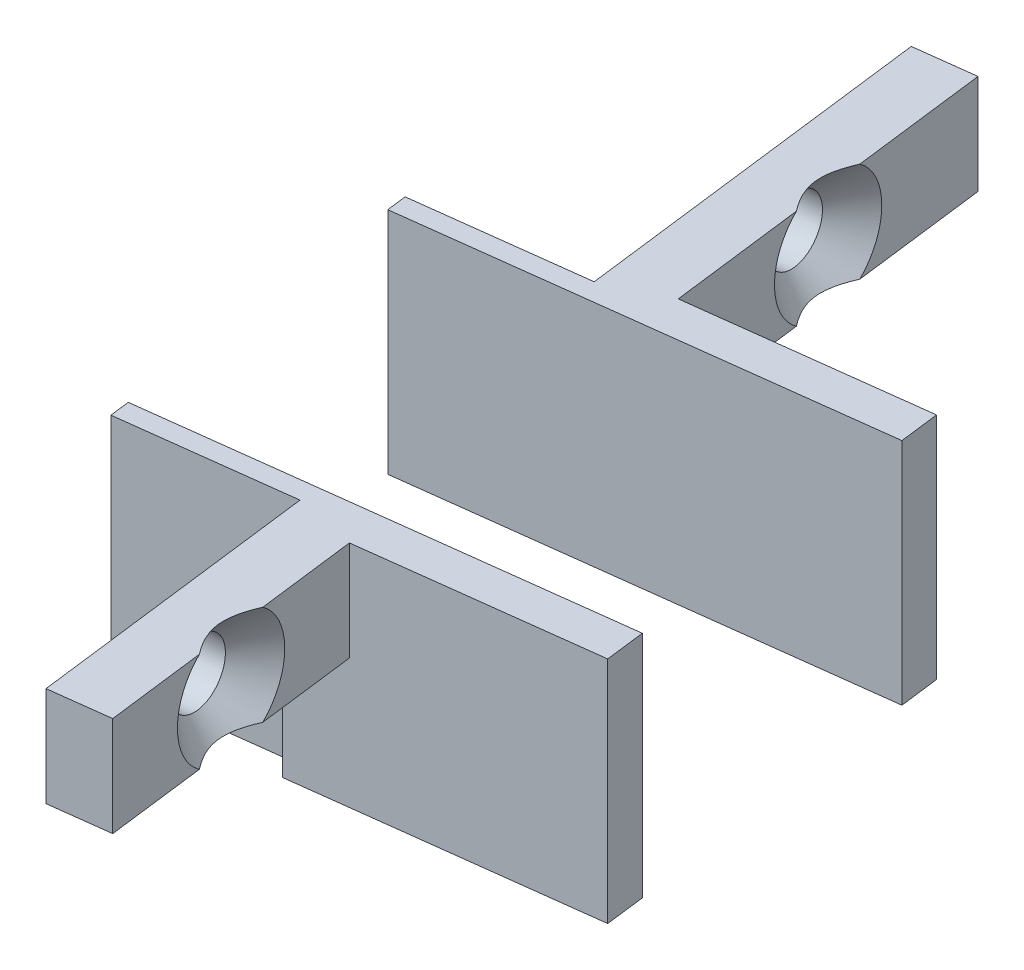
ISO-10303-21;
HEADER;
FILE_DESCRIPTION(('STEP AP214'),'2;1');
FILE_NAME('part.step','',(''),(''),'','','');
FILE_SCHEMA(('AUTOMOTIVE_DESIGN { 1 0 10303 214 1 1 1 1 }'));
ENDSEC;
DATA;
#1=APPLICATION_CONTEXT('core data for automotive mechanical design processes');
#2=APPLICATION_PROTOCOL_DEFINITION('international standard','automotive_design',2000,#1);
#3=PRODUCT_CONTEXT('',#1,'mechanical');
#4=PRODUCT('Part','Part','',(#3));
#5=PRODUCT_RELATED_PRODUCT_CATEGORY('part','',(#4));
#6=PRODUCT_DEFINITION_FORMATION('','',#4);
#7=PRODUCT_DEFINITION_CONTEXT('part definition',#1,'design');
#8=PRODUCT_DEFINITION('design','',#6,#7);
#9=PRODUCT_DEFINITION_SHAPE('','',#8);
#10=(LENGTH_UNIT() NAMED_UNIT(*) SI_UNIT(.MILLI.,.METRE.));
#11=(NAMED_UNIT(*) PLANE_ANGLE_UNIT() SI_UNIT($,.RADIAN.));
#12=(NAMED_UNIT(*) SI_UNIT($,.STERADIAN.) SOLID_ANGLE_UNIT());
#13=UNCERTAINTY_MEASURE_WITH_UNIT(LENGTH_MEASURE(1.E-05),#10,'distance_accuracy_value','');
#14=(GEOMETRIC_REPRESENTATION_CONTEXT(3) GLOBAL_UNCERTAINTY_ASSIGNED_CONTEXT((#13)) GLOBAL_UNIT_ASSIGNED_CONTEXT((#10,
#11,#12)) REPRESENTATION_CONTEXT('',''));
#15=CARTESIAN_POINT('',(0.,0.,0.));
#16=DIRECTION('',(0.,0.,1.));
#17=DIRECTION('',(1.,0.,0.));
#18=AXIS2_PLACEMENT_3D('',#15,#16,#17);
#19=CARTESIAN_POINT('',(114.758192533677,-13.5,-167.394485901356));
#20=DIRECTION('',(-0.123954699359963,0.,-0.992287877839179));
#21=DIRECTION('',(-0.992287877839179,0.,0.123954699359963));
#22=AXIS2_PLACEMENT_3D('',#19,#20,#21);
#23=PLANE('',#22);
#24=DIRECTION('',(-0.992287877839179,0.,0.123954699359963));
#25=VECTOR('',#24,1.);
#26=CARTESIAN_POINT('',(114.758192533677,-13.5,-167.394485901356));
#27=LINE('',#26,#25);
#28=CARTESIAN_POINT('',(129.256443078158,-13.5,-169.205579564417));
#29=VERTEX_POINT('',#28);
#30=CARTESIAN_POINT('',(114.758192533677,-13.5,-167.394485901356));
#31=VERTEX_POINT('',#30);
#32=EDGE_CURVE('E235',#29,#31,#27,.T.);
#33=ORIENTED_EDGE('',*,*,#32,.F.);
#34=DIRECTION('',(0.,1.,0.));
#35=VECTOR('',#34,1.);
#36=CARTESIAN_POINT('',(129.256443078158,-13.5,-169.205579564417));
#37=LINE('',#36,#35);
#38=CARTESIAN_POINT('',(129.256443078158,-2.,-169.205579564417));
#39=VERTEX_POINT('',#38);
#40=EDGE_CURVE('E206',#29,#39,#37,.T.);
#41=ORIENTED_EDGE('',*,*,#40,.T.);
#42=DIRECTION('',(-0.992287877839179,0.,0.123954699359963));
#43=VECTOR('',#42,1.);
#44=CARTESIAN_POINT('',(114.758192533677,-2.,-167.394485901356));
#45=LINE('',#44,#43);
#46=CARTESIAN_POINT('',(117.735056167195,-2.,-167.766349999436));
#47=VERTEX_POINT('',#46);
#48=EDGE_CURVE('E205',#39,#47,#45,.T.);
#49=ORIENTED_EDGE('',*,*,#48,.T.);
#50=DIRECTION('',(0.,1.,0.));
#51=VECTOR('',#50,1.);
#52=CARTESIAN_POINT('',(117.735056167195,-7.,-167.766349999436));
#53=LINE('',#52,#51);
#54=CARTESIAN_POINT('',(117.735056167195,-7.,-167.766349999436));
#55=VERTEX_POINT('',#54);
#56=EDGE_CURVE('E214',#55,#47,#53,.T.);
#57=ORIENTED_EDGE('',*,*,#56,.F.);
#58=DIRECTION('',(0.992287877839179,0.,-0.123954699359962));
#59=VECTOR('',#58,1.);
#60=CARTESIAN_POINT('',(117.735056167195,-7.,-167.766349999436));
#61=LINE('',#60,#59);
#62=CARTESIAN_POINT('',(114.758192533677,-7.,-167.394485901356));
#63=VERTEX_POINT('',#62);
#64=EDGE_CURVE('E193',#63,#55,#61,.T.);
#65=ORIENTED_EDGE('',*,*,#64,.F.);
#66=DIRECTION('',(0.,1.,0.));
#67=VECTOR('',#66,1.);
#68=CARTESIAN_POINT('',(114.758192533677,-13.5,-167.394485901356));
#69=LINE('',#68,#67);
#70=EDGE_CURVE('E204',#31,#63,#69,.T.);
#71=ORIENTED_EDGE('',*,*,#70,.F.);
#72=EDGE_LOOP('',(#33,#41,#49,#57,#65,#71));
#73=FACE_BOUND('',#72,.T.);
#74=ADVANCED_FACE('F70',(#73),#23,.F.);
#75=CARTESIAN_POINT('',(148.082521914135,0.5,-18.4981847448383));
#76=DIRECTION('',(-0.992287877839178,0.,0.123954699359969));
#77=DIRECTION('',(0.123954699359969,0.,0.992287877839178));
#78=AXIS2_PLACEMENT_3D('',#75,#76,#77);
#79=PLANE('',#78);
#80=DIRECTION('',(-0.123954699359969,0.,-0.992287877839178));
#81=VECTOR('',#80,1.);
#82=CARTESIAN_POINT('',(148.082521914135,-2.,-18.4981847448383));
#83=LINE('',#82,#81);
#84=CARTESIAN_POINT('',(129.008533679438,-2.,-171.190155320095));
#85=VERTEX_POINT('',#84);
#86=EDGE_CURVE('E241',#39,#85,#83,.T.);
#87=ORIENTED_EDGE('',*,*,#86,.F.);
#88=ORIENTED_EDGE('',*,*,#40,.F.);
#89=DIRECTION('',(0.123954699359969,0.,0.992287877839178));
#90=VECTOR('',#89,1.);
#91=CARTESIAN_POINT('',(148.082521914135,-13.5,-18.4981847448383));
#92=LINE('',#91,#90);
#93=CARTESIAN_POINT('',(129.008533679438,-13.5,-171.190155320095));
#94=VERTEX_POINT('',#93);
#95=EDGE_CURVE('E217',#94,#29,#92,.T.);
#96=ORIENTED_EDGE('',*,*,#95,.F.);
#97=DIRECTION('',(0.,1.,0.));
#98=VECTOR('',#97,1.);
#99=CARTESIAN_POINT('',(129.008533679438,-13.5,-171.190155320095));
#100=LINE('',#99,#98);
#101=EDGE_CURVE('E201',#94,#85,#100,.T.);
#102=ORIENTED_EDGE('',*,*,#101,.T.);
#103=EDGE_LOOP('',(#87,#88,#96,#102));
#104=FACE_BOUND('',#103,.T.);
#105=ADVANCED_FACE('F264',(#104),#79,.F.);
#106=CARTESIAN_POINT('',(118.538810864156,-2.,-137.129705627261));
#107=DIRECTION('',(0.992287877839178,0.,-0.12395469935997));
#108=DIRECTION('',(-0.12395469935997,0.,-0.992287877839178));
#109=AXIS2_PLACEMENT_3D('',#106,#107,#108);
#110=PLANE('',#109);
#111=CARTESIAN_POINT('',(115.60588337206,-4.5,-160.608512094586));
#112=DIRECTION('',(0.992287877839178,0.,-0.12395469935997));
#113=DIRECTION('',(-0.12395469935997,0.,-0.992287877839178));
#114=AXIS2_PLACEMENT_3D('',#111,#112,#113);
#115=CIRCLE('',#114,1.59999999999997);
#116=CARTESIAN_POINT('',(115.407555853084,-4.5,-162.196172699129));
#117=VERTEX_POINT('',#116);
#118=EDGE_CURVE('E192',#117,#117,#115,.F.);
#119=ORIENTED_EDGE('',*,*,#118,.F.);
#120=EDGE_LOOP('',(#119));
#121=FACE_BOUND('',#120,.T.);
#122=DIRECTION('',(0.12395469935997,0.,0.992287877839178));
#123=VECTOR('',#122,1.);
#124=CARTESIAN_POINT('',(118.538810864156,-2.,-137.129705627261));
#125=LINE('',#124,#123);
#126=CARTESIAN_POINT('',(114.634237834317,-2.,-168.386773779195));
#127=VERTEX_POINT('',#126);
#128=CARTESIAN_POINT('',(116.453574210443,-2.,-153.822538287816));
#129=VERTEX_POINT('',#128);
#130=EDGE_CURVE('E232',#127,#129,#125,.T.);
#131=ORIENTED_EDGE('',*,*,#130,.F.);
#132=DIRECTION('',(0.,1.,0.));
#133=VECTOR('',#132,1.);
#134=CARTESIAN_POINT('',(114.634237834317,-2.,-168.386773779195));
#135=LINE('',#134,#133);
#136=CARTESIAN_POINT('',(114.634237834317,-13.5,-168.386773779195));
#137=VERTEX_POINT('',#136);
#138=EDGE_CURVE('E194',#137,#127,#135,.T.);
#139=ORIENTED_EDGE('',*,*,#138,.F.);
#140=DIRECTION('',(-0.12395469935997,0.,-0.992287877839178));
#141=VECTOR('',#140,1.);
#142=CARTESIAN_POINT('',(118.538810864156,-13.5,-137.129705627261));
#143=LINE('',#142,#141);
#144=EDGE_CURVE('E80',#31,#137,#143,.T.);
#145=ORIENTED_EDGE('',*,*,#144,.F.);
#146=ORIENTED_EDGE('',*,*,#70,.T.);
#147=DIRECTION('',(-0.123954699359968,0.,-0.992287877839178));
#148=VECTOR('',#147,1.);
#149=CARTESIAN_POINT('',(116.453574210443,-7.,-153.822538287816));
#150=LINE('',#149,#148);
#151=CARTESIAN_POINT('',(116.453574210443,-7.,-153.822538287816));
#152=VERTEX_POINT('',#151);
#153=EDGE_CURVE('E227',#152,#63,#150,.T.);
#154=ORIENTED_EDGE('',*,*,#153,.F.);
#155=DIRECTION('',(0.,1.,0.));
#156=VECTOR('',#155,1.);
#157=CARTESIAN_POINT('',(116.453574210443,-7.,-153.822538287816));
#158=LINE('',#157,#156);
#159=EDGE_CURVE('E198',#152,#129,#158,.T.);
#160=ORIENTED_EDGE('',*,*,#159,.T.);
#161=EDGE_LOOP('',(#131,#139,#145,#146,#154,#160));
#162=FACE_BOUND('',#161,.T.);
#163=ADVANCED_FACE('F259',(#121,#162),#110,.F.);
#164=CARTESIAN_POINT('',(106.199790872684,-2.,-167.333158834636));
#165=DIRECTION('',(-0.123954699359963,0.,-0.992287877839179));
#166=DIRECTION('',(-0.992287877839179,0.,0.123954699359963));
#167=AXIS2_PLACEMENT_3D('',#164,#165,#166);
#168=PLANE('',#167);
#169=DIRECTION('',(0.992287877839179,0.,-0.123954699359963));
#170=VECTOR('',#169,1.);
#171=CARTESIAN_POINT('',(106.199790872684,-2.,-167.333158834636));
#172=LINE('',#171,#170);
#173=CARTESIAN_POINT('',(106.199790872684,-2.,-167.333158834636));
#174=VERTEX_POINT('',#173);
#175=EDGE_CURVE('E237',#174,#127,#172,.T.);
#176=ORIENTED_EDGE('',*,*,#175,.F.);
#177=DIRECTION('',(0.,1.,0.));
#178=VECTOR('',#177,1.);
#179=CARTESIAN_POINT('',(106.199790872684,-2.,-167.333158834636));
#180=LINE('',#179,#178);
#181=CARTESIAN_POINT('',(106.199790872684,-13.5,-167.333158834636));
#182=VERTEX_POINT('',#181);
#183=EDGE_CURVE('E197',#182,#174,#180,.T.);
#184=ORIENTED_EDGE('',*,*,#183,.F.);
#185=DIRECTION('',(-0.992287877839179,0.,0.123954699359963));
#186=VECTOR('',#185,1.);
#187=CARTESIAN_POINT('',(106.199790872684,-13.5,-167.333158834636));
#188=LINE('',#187,#186);
#189=EDGE_CURVE('E13',#137,#182,#188,.T.);
#190=ORIENTED_EDGE('',*,*,#189,.F.);
#191=ORIENTED_EDGE('',*,*,#138,.T.);
#192=EDGE_LOOP('',(#176,#184,#190,#191));
#193=FACE_BOUND('',#192,.T.);
#194=ADVANCED_FACE('F263',(#193),#168,.F.);
#195=CARTESIAN_POINT('',(104.092560983565,-2.,-184.202052757902));
#196=DIRECTION('',(0.992287877839178,0.,-0.123954699359969));
#197=DIRECTION('',(-0.123954699359969,0.,-0.992287877839178));
#198=AXIS2_PLACEMENT_3D('',#195,#196,#197);
#199=PLANE('',#198);
#200=DIRECTION('',(0.123954699359969,0.,0.992287877839178));
#201=VECTOR('',#200,1.);
#202=CARTESIAN_POINT('',(104.092560983565,-2.,-184.202052757902));
#203=LINE('',#202,#201);
#204=CARTESIAN_POINT('',(106.075836173324,-2.,-168.325446712475));
#205=VERTEX_POINT('',#204);
#206=EDGE_CURVE('E74',#205,#174,#203,.T.);
#207=ORIENTED_EDGE('',*,*,#206,.F.);
#208=DIRECTION('',(0.,1.,0.));
#209=VECTOR('',#208,1.);
#210=CARTESIAN_POINT('',(106.075836173324,-2.,-168.325446712475));
#211=LINE('',#210,#209);
#212=CARTESIAN_POINT('',(106.075836173324,-13.5,-168.325446712475));
#213=VERTEX_POINT('',#212);
#214=EDGE_CURVE('E179',#213,#205,#211,.T.);
#215=ORIENTED_EDGE('',*,*,#214,.F.);
#216=DIRECTION('',(-0.123954699359969,0.,-0.992287877839178));
#217=VECTOR('',#216,1.);
#218=CARTESIAN_POINT('',(104.092560983565,-13.5,-184.202052757902));
#219=LINE('',#218,#217);
#220=EDGE_CURVE('E218',#182,#213,#219,.T.);
#221=ORIENTED_EDGE('',*,*,#220,.F.);
#222=ORIENTED_EDGE('',*,*,#183,.T.);
#223=EDGE_LOOP('',(#207,#215,#221,#222));
#224=FACE_BOUND('',#223,.T.);
#225=ADVANCED_FACE('F268',(#224),#199,.F.);
#226=CARTESIAN_POINT('',(119.430437843961,-7.,-154.194402385896));
#227=DIRECTION('',(-0.992287877839179,0.,0.123954699359959));
#228=DIRECTION('',(0.123954699359959,0.,0.99228787783918));
#229=AXIS2_PLACEMENT_3D('',#226,#227,#228);
#230=PLANE('',#229);
#231=DIRECTION('',(0.123954699359959,0.,0.992287877839179));
#232=VECTOR('',#231,1.);
#233=CARTESIAN_POINT('',(119.430437843961,-2.,-154.194402385896));
#234=LINE('',#233,#232);
#235=CARTESIAN_POINT('',(118.355534288553,-2.,-162.79926991722));
#236=VERTEX_POINT('',#235);
#237=EDGE_CURVE('E182',#47,#236,#234,.T.);
#238=ORIENTED_EDGE('',*,*,#237,.T.);
#239=CARTESIAN_POINT('',(118.582747005578,-4.5,-160.980376192666));
#240=DIRECTION('',(-0.992287877839179,0.,0.123954699359959));
#241=DIRECTION('',(0.123954699359959,0.,0.99228787783918));
#242=AXIS2_PLACEMENT_3D('',#239,#240,#241);
#243=CIRCLE('',#242,3.09999999999998);
#244=CARTESIAN_POINT('',(118.355534288553,-7.,-162.79926991722));
#245=VERTEX_POINT('',#244);
#246=EDGE_CURVE('E188',#236,#245,#243,.T.);
#247=ORIENTED_EDGE('',*,*,#246,.T.);
#248=DIRECTION('',(0.123954699359959,0.,0.992287877839179));
#249=VECTOR('',#248,1.);
#250=CARTESIAN_POINT('',(119.430437843961,-7.,-154.194402385896));
#251=LINE('',#250,#249);
#252=EDGE_CURVE('E161',#55,#245,#251,.T.);
#253=ORIENTED_EDGE('',*,*,#252,.F.);
#254=ORIENTED_EDGE('',*,*,#56,.T.);
#255=EDGE_LOOP('',(#238,#247,#253,#254));
#256=FACE_BOUND('',#255,.T.);
#257=ADVANCED_FACE('F273',(#256),#230,.F.);
#258=CARTESIAN_POINT('',(114.510283134957,-13.5,-169.379061657034));
#259=DIRECTION('',(0.123954699359963,0.,0.992287877839179));
#260=DIRECTION('',(0.992287877839179,0.,-0.123954699359963));
#261=AXIS2_PLACEMENT_3D('',#258,#259,#260);
#262=PLANE('',#261);
#263=DIRECTION('',(0.992287877839179,0.,-0.123954699359963));
#264=VECTOR('',#263,1.);
#265=CARTESIAN_POINT('',(114.510283134957,-2.,-169.379061657034));
#266=LINE('',#265,#264);
#267=EDGE_CURVE('E184',#205,#85,#266,.T.);
#268=ORIENTED_EDGE('',*,*,#267,.T.);
#269=ORIENTED_EDGE('',*,*,#101,.F.);
#270=DIRECTION('',(0.992287877839179,0.,-0.123954699359962));
#271=VECTOR('',#270,1.);
#272=CARTESIAN_POINT('',(114.510283134957,-13.5,-169.379061657034));
#273=LINE('',#272,#271);
#274=EDGE_CURVE('E215',#213,#94,#273,.T.);
#275=ORIENTED_EDGE('',*,*,#274,.F.);
#276=ORIENTED_EDGE('',*,*,#214,.T.);
#277=EDGE_LOOP('',(#268,#269,#275,#276));
#278=FACE_BOUND('',#277,.T.);
#279=ADVANCED_FACE('F270',(#278),#262,.F.);
#280=CARTESIAN_POINT('',(118.809959722603,-7.,-159.161482468112));
#281=VERTEX_POINT('',#280);
#282=CARTESIAN_POINT('',(119.430437843961,-7.,-154.194402385896));
#283=VERTEX_POINT('',#282);
#284=EDGE_CURVE('E153',#281,#283,#251,.T.);
#285=ORIENTED_EDGE('',*,*,#284,.F.);
#286=CARTESIAN_POINT('',(118.582747005578,-4.5,-160.980376192666));
#287=DIRECTION('',(-0.992287877839179,0.,0.123954699359959));
#288=DIRECTION('',(0.123954699359959,0.,0.99228787783918));
#289=AXIS2_PLACEMENT_3D('',#286,#287,#288);
#290=CIRCLE('',#289,3.09999999999998);
#291=CARTESIAN_POINT('',(118.809959722603,-2.,-159.161482468112));
#292=VERTEX_POINT('',#291);
#293=EDGE_CURVE('E170',#281,#292,#290,.T.);
#294=ORIENTED_EDGE('',*,*,#293,.T.);
#295=CARTESIAN_POINT('',(119.430437843961,-2.,-154.194402385896));
#296=VERTEX_POINT('',#295);
#297=EDGE_CURVE('E134',#292,#296,#234,.T.);
#298=ORIENTED_EDGE('',*,*,#297,.T.);
#299=DIRECTION('',(0.,1.,0.));
#300=VECTOR('',#299,1.);
#301=CARTESIAN_POINT('',(119.430437843961,-7.,-154.194402385896));
#302=LINE('',#301,#300);
#303=EDGE_CURVE('E173',#283,#296,#302,.T.);
#304=ORIENTED_EDGE('',*,*,#303,.F.);
#305=EDGE_LOOP('',(#285,#294,#298,#304));
#306=FACE_BOUND('',#305,.T.);
#307=ADVANCED_FACE('F169',(#306),#230,.F.);
#308=CARTESIAN_POINT('',(119.430437843961,-7.,-154.194402385896));
#309=DIRECTION('',(-0.123954699359958,0.,-0.992287877839179));
#310=DIRECTION('',(-0.99228787783918,0.,0.123954699359958));
#311=AXIS2_PLACEMENT_3D('',#308,#309,#310);
#312=PLANE('',#311);
#313=DIRECTION('',(-0.99228787783918,0.,0.123954699359958));
#314=VECTOR('',#313,1.);
#315=CARTESIAN_POINT('',(119.430437843961,-2.,-154.194402385896));
#316=LINE('',#315,#314);
#317=EDGE_CURVE('E130',#296,#129,#316,.T.);
#318=ORIENTED_EDGE('',*,*,#317,.T.);
#319=ORIENTED_EDGE('',*,*,#159,.F.);
#320=DIRECTION('',(-0.99228787783918,0.,0.123954699359958));
#321=VECTOR('',#320,1.);
#322=CARTESIAN_POINT('',(119.430437843961,-7.,-154.194402385896));
#323=LINE('',#322,#321);
#324=EDGE_CURVE('E174',#283,#152,#323,.T.);
#325=ORIENTED_EDGE('',*,*,#324,.F.);
#326=ORIENTED_EDGE('',*,*,#303,.T.);
#327=EDGE_LOOP('',(#318,#319,#325,#326));
#328=FACE_BOUND('',#327,.T.);
#329=ADVANCED_FACE('F280',(#328),#312,.F.);
#330=CARTESIAN_POINT('',(0.,-7.,0.));
#331=DIRECTION('',(0.,1.,0.));
#332=DIRECTION('',(0.,0.,1.));
#333=AXIS2_PLACEMENT_3D('',#330,#331,#332);
#334=PLANE('',#333);
#335=ORIENTED_EDGE('',*,*,#252,.T.);
#336=CARTESIAN_POINT('',(118.355534288553,-7.,-162.79926991722));
#337=CARTESIAN_POINT('',(118.313251604489,-7.,-162.70177731745));
#338=CARTESIAN_POINT('',(118.272920492595,-7.,-162.603347849116));
#339=CARTESIAN_POINT('',(118.197506238997,-7.,-162.404059259598));
#340=CARTESIAN_POINT('',(118.162444877074,-7.,-162.303191952709));
#341=CARTESIAN_POINT('',(118.098759955325,-7.,-162.097576314714));
#342=CARTESIAN_POINT('',(118.070251818737,-7.,-161.992791433211));
#343=CARTESIAN_POINT('',(118.022573421606,-7.,-161.781212086236));
#344=CARTESIAN_POINT('',(118.003388575661,-7.,-161.674421032882));
#345=CARTESIAN_POINT('',(117.980653713786,-7.,-161.492180969516));
#346=CARTESIAN_POINT('',(117.974119934172,-7.,-161.417105248466));
#347=CARTESIAN_POINT('',(117.96729543441,-7.,-161.266649676558));
#348=CARTESIAN_POINT('',(117.967004825271,-7.,-161.191269820316));
#349=CARTESIAN_POINT('',(117.973085665843,-7.,-161.041409882405));
#350=CARTESIAN_POINT('',(117.979400842356,-7.,-160.966927579927));
#351=CARTESIAN_POINT('',(117.998696738772,-7.,-160.818834138328));
#352=CARTESIAN_POINT('',(118.011677291952,-7.,-160.745222977465));
#353=CARTESIAN_POINT('',(118.043978031764,-7.,-160.599633699188));
#354=CARTESIAN_POINT('',(118.06327997036,-7.,-160.527651511395));
#355=CARTESIAN_POINT('',(118.107662460967,-7.,-160.385478050785));
#356=CARTESIAN_POINT('',(118.132745891796,-7.,-160.315287689589));
#357=CARTESIAN_POINT('',(118.215962680433,-7.,-160.106758547348));
#358=CARTESIAN_POINT('',(118.281822125452,-7.,-159.97146945808));
#359=CARTESIAN_POINT('',(118.388199423161,-7.,-159.780346366422));
#360=CARTESIAN_POINT('',(118.423100518821,-7.,-159.721197726241));
#361=CARTESIAN_POINT('',(118.495439435366,-7.,-159.604448529857));
#362=CARTESIAN_POINT('',(118.532877453822,-7.,-159.546848094714));
#363=CARTESIAN_POINT('',(118.609308452762,-7.,-159.433900864561));
#364=CARTESIAN_POINT('',(118.648271490717,-7.,-159.37853360949));
#365=CARTESIAN_POINT('',(118.727907651966,-7.,-159.269086177044));
#366=CARTESIAN_POINT('',(118.768579845289,-7.,-159.215005324181));
#367=CARTESIAN_POINT('',(118.809959722603,-7.,-159.161482468112));
#368=B_SPLINE_CURVE_WITH_KNOTS('',3,(#336,#337,#338,#339,#340,#341,#342,#343,#344,#345,#346,
#347,#348,#349,#350,#351,#352,#353,#354,#355,#356,#357,#358,#359,#360,#361,#362,#363,#364,#365,
#366,#367),.UNSPECIFIED.,.F.,.F.,(4,2,2,2,2,2,2,2,2,2,2,2,2,2,2,4),(0.,0.318904525234709,
0.639092830685344,0.964549655162288,1.28949568111794,1.51534879905908,1.74120593289234,
1.96515458920309,2.18909764408827,2.41239985495346,2.63581349731348,3.0857165933188,
3.29172565431704,3.49775077730028,3.70082575042696,3.90379162355589),.UNSPECIFIED.);
#369=EDGE_CURVE('E157',#245,#281,#368,.T.);
#370=ORIENTED_EDGE('',*,*,#369,.T.);
#371=ORIENTED_EDGE('',*,*,#284,.T.);
#372=ORIENTED_EDGE('',*,*,#324,.T.);
#373=ORIENTED_EDGE('',*,*,#153,.T.);
#374=ORIENTED_EDGE('',*,*,#64,.T.);
#375=EDGE_LOOP('',(#335,#370,#371,#372,#373,#374));
#376=FACE_BOUND('',#375,.T.);
#377=ADVANCED_FACE('F158',(#376),#334,.F.);
#378=CARTESIAN_POINT('',(97.2120797867411,-4.5,-158.310793413925));
#379=DIRECTION('',(0.992287877839179,0.,-0.123954699359959));
#380=DIRECTION('',(-0.123954699359959,0.,-0.99228787783918));
#381=AXIS2_PLACEMENT_3D('',#378,#379,#380);
#382=CYLINDRICAL_SURFACE('',#381,1.59999999999997);
#383=CARTESIAN_POINT('',(117.094315188819,-4.5,-160.794444143626));
#384=DIRECTION('',(-0.99228787783918,0.,0.123954699359958));
#385=DIRECTION('',(0.123954699359958,0.,0.99228787783918));
#386=AXIS2_PLACEMENT_3D('',#383,#384,#385);
#387=CIRCLE('',#386,1.59999999999997);
#388=CARTESIAN_POINT('',(117.292642707795,-4.5,-159.206783539083));
#389=VERTEX_POINT('',#388);
#390=EDGE_CURVE('E189',#389,#389,#387,.F.);
#391=ORIENTED_EDGE('',*,*,#390,.T.);
#392=EDGE_LOOP('',(#391));
#393=FACE_BOUND('',#392,.T.);
#394=ORIENTED_EDGE('',*,*,#118,.T.);
#395=EDGE_LOOP('',(#394));
#396=FACE_BOUND('',#395,.T.);
#397=ADVANCED_FACE('F258',(#393,#396),#382,.F.);
#398=CARTESIAN_POINT('',(117.094315188819,-4.5,-160.794444143626));
#399=DIRECTION('',(0.99228787783918,0.,-0.123954699359958));
#400=DIRECTION('',(-0.123954699359958,0.,-0.99228787783918));
#401=AXIS2_PLACEMENT_3D('',#398,#399,#400);
#402=CONICAL_SURFACE('',#401,1.59999999999997,0.785398163397447);
#403=ORIENTED_EDGE('',*,*,#369,.F.);
#404=ORIENTED_EDGE('',*,*,#246,.F.);
#405=CARTESIAN_POINT('',(118.809959722603,-2.,-159.161482468112));
#406=CARTESIAN_POINT('',(118.744993430809,-2.,-159.245577731427));
#407=CARTESIAN_POINT('',(118.681688272964,-2.,-159.331061155629));
#408=CARTESIAN_POINT('',(118.559566971274,-2.,-159.505673982281));
#409=CARTESIAN_POINT('',(118.500769924264,-2.,-159.594816676665));
#410=CARTESIAN_POINT('',(118.388461079458,-2.,-159.778447510743));
#411=CARTESIAN_POINT('',(118.33505216669,-2.,-159.872999471486));
#412=CARTESIAN_POINT('',(118.236790915996,-2.,-160.06634831744));
#413=CARTESIAN_POINT('',(118.191925280243,-2.,-160.165138307412));
#414=CARTESIAN_POINT('',(118.125058451726,-2.,-160.336185499392));
#415=CARTESIAN_POINT('',(118.100257013097,-2.,-160.407346885053));
#416=CARTESIAN_POINT('',(118.05663053382,-2.,-160.55150021738));
#417=CARTESIAN_POINT('',(118.037805599446,-2.,-160.624492196573));
#418=CARTESIAN_POINT('',(118.006834409864,-2.,-160.771242879803));
#419=CARTESIAN_POINT('',(117.994633064394,-2.,-160.844989893341));
#420=CARTESIAN_POINT('',(117.976905391797,-2.,-160.993279234452));
#421=CARTESIAN_POINT('',(117.971378897721,-2.,-161.067821542088));
#422=CARTESIAN_POINT('',(117.966872453624,-2.,-161.2168828305));
#423=CARTESIAN_POINT('',(117.967873815018,-2.,-161.291401267604));
#424=CARTESIAN_POINT('',(117.975918137709,-2.,-161.440123785223));
#425=CARTESIAN_POINT('',(117.982964113615,-2.,-161.514327690313));
#426=CARTESIAN_POINT('',(118.012326043211,-2.,-161.736919950208));
#427=CARTESIAN_POINT('',(118.04288088157,-2.,-161.884252926917));
#428=CARTESIAN_POINT('',(118.098973453338,-2.,-162.095671443195));
#429=CARTESIAN_POINT('',(118.118251637467,-2.,-162.161588055139));
#430=CARTESIAN_POINT('',(118.159647603341,-2.,-162.292544794991));
#431=CARTESIAN_POINT('',(118.181765606365,-2.,-162.357584854161));
#432=CARTESIAN_POINT('',(118.228063180999,-2.,-162.485863102438));
#433=CARTESIAN_POINT('',(118.252208697076,-2.,-162.549113757092));
#434=CARTESIAN_POINT('',(118.302473882328,-2.,-162.674788216706));
#435=CARTESIAN_POINT('',(118.328592483939,-2.,-162.737212447626));
#436=CARTESIAN_POINT('',(118.355534288553,-2.,-162.79926991722));
#437=B_SPLINE_CURVE_WITH_KNOTS('',3,(#405,#406,#407,#408,#409,#410,#411,#412,#413,#414,#415,
#416,#417,#418,#419,#420,#421,#422,#423,#424,#425,#426,#427,#428,#429,#430,#431,#432,#433,#434,
#435,#436),.UNSPECIFIED.,.F.,.F.,(4,2,2,2,2,2,2,2,2,2,2,2,2,2,2,4),(0.,0.318904525234667,
0.639092830685317,0.964549655162299,1.28949568111792,1.51534879905909,1.74120593289231,
1.965154589203,2.18909764408827,2.41239985495346,2.6358134973135,3.08571659331878,
3.29172565431701,3.49775077730025,3.70082575042692,3.90379162355588),.UNSPECIFIED.);
#438=EDGE_CURVE('E178',#292,#236,#437,.T.);
#439=ORIENTED_EDGE('',*,*,#438,.F.);
#440=ORIENTED_EDGE('',*,*,#293,.F.);
#441=EDGE_LOOP('',(#403,#404,#439,#440));
#442=FACE_BOUND('',#441,.T.);
#443=ORIENTED_EDGE('',*,*,#390,.F.);
#444=EDGE_LOOP('',(#443));
#445=FACE_BOUND('',#444,.T.);
#446=ADVANCED_FACE('F176',(#442,#445),#402,.F.);
#447=CARTESIAN_POINT('',(132.945927004418,-2.,-106.61491021869));
#448=DIRECTION('',(0.,1.,0.));
#449=DIRECTION('',(0.,0.,1.));
#450=AXIS2_PLACEMENT_3D('',#447,#448,#449);
#451=PLANE('',#450);
#452=ORIENTED_EDGE('',*,*,#130,.T.);
#453=ORIENTED_EDGE('',*,*,#317,.F.);
#454=ORIENTED_EDGE('',*,*,#297,.F.);
#455=ORIENTED_EDGE('',*,*,#438,.T.);
#456=ORIENTED_EDGE('',*,*,#237,.F.);
#457=ORIENTED_EDGE('',*,*,#48,.F.);
#458=ORIENTED_EDGE('',*,*,#86,.T.);
#459=ORIENTED_EDGE('',*,*,#267,.F.);
#460=ORIENTED_EDGE('',*,*,#206,.T.);
#461=ORIENTED_EDGE('',*,*,#175,.T.);
#462=EDGE_LOOP('',(#452,#453,#454,#455,#456,#457,#458,#459,#460,#461));
#463=FACE_BOUND('',#462,.T.);
#464=ADVANCED_FACE('F257',(#463),#451,.T.);
#465=CARTESIAN_POINT('',(132.945927004418,-13.5,-117.929015650912));
#466=DIRECTION('',(0.,-1.,0.));
#467=DIRECTION('',(0.,0.,-1.));
#468=AXIS2_PLACEMENT_3D('',#465,#466,#467);
#469=PLANE('',#468);
#470=ORIENTED_EDGE('',*,*,#220,.T.);
#471=ORIENTED_EDGE('',*,*,#274,.T.);
#472=ORIENTED_EDGE('',*,*,#95,.T.);
#473=ORIENTED_EDGE('',*,*,#32,.T.);
#474=ORIENTED_EDGE('',*,*,#144,.T.);
#475=ORIENTED_EDGE('',*,*,#189,.T.);
#476=EDGE_LOOP('',(#470,#471,#472,#473,#474,#475));
#477=FACE_BOUND('',#476,.T.);
#478=ADVANCED_FACE('F296',(#477),#469,.T.);
#479=CLOSED_SHELL('',(#74,#105,#163,#194,#225,#257,#279,#307,#329,#377,#397,#446,#464,#478));
#480=MANIFOLD_SOLID_BREP('B2',#479);
#481=CARTESIAN_POINT('',(92.9356426588225,-4.5,-192.544725199377));
#482=DIRECTION('',(0.992287877839179,0.,-0.123954699359959));
#483=DIRECTION('',(-0.123954699359959,0.,-0.99228787783918));
#484=AXIS2_PLACEMENT_3D('',#481,#482,#483);
#485=CYLINDRICAL_SURFACE('',#484,1.6);
#486=CARTESIAN_POINT('',(112.817878060901,-4.5,-195.028375929078));
#487=DIRECTION('',(-0.992287877839179,0.,0.123954699359966));
#488=DIRECTION('',(0.123954699359966,0.,0.992287877839179));
#489=AXIS2_PLACEMENT_3D('',#486,#487,#488);
#490=CIRCLE('',#489,1.6);
#491=CARTESIAN_POINT('',(113.016205579877,-4.5,-193.440715324535));
#492=VERTEX_POINT('',#491);
#493=EDGE_CURVE('E564',#492,#492,#490,.F.);
#494=ORIENTED_EDGE('',*,*,#493,.T.);
#495=EDGE_LOOP('',(#494));
#496=FACE_BOUND('',#495,.T.);
#497=CARTESIAN_POINT('',(111.329446244141,-4.5,-194.842443880038));
#498=DIRECTION('',(0.992287877839178,0.,-0.123954699359969));
#499=DIRECTION('',(-0.123954699359969,0.,-0.992287877839178));
#500=AXIS2_PLACEMENT_3D('',#497,#498,#499);
#501=CIRCLE('',#500,1.6);
#502=CARTESIAN_POINT('',(111.131118725165,-4.5,-196.43010448458));
#503=VERTEX_POINT('',#502);
#504=EDGE_CURVE('E622',#503,#503,#501,.F.);
#505=ORIENTED_EDGE('',*,*,#504,.T.);
#506=EDGE_LOOP('',(#505));
#507=FACE_BOUND('',#506,.T.);
#508=ADVANCED_FACE('F454',(#496,#507),#485,.F.);
#509=CARTESIAN_POINT('',(0.,-7.,0.));
#510=DIRECTION('',(0.,1.,0.));
#511=DIRECTION('',(0.,0.,1.));
#512=AXIS2_PLACEMENT_3D('',#509,#510,#511);
#513=PLANE('',#512);
#514=DIRECTION('',(0.12395469935997,0.,0.992287877839178));
#515=VECTOR('',#514,1.);
#516=CARTESIAN_POINT('',(113.232702875962,-7.,-203.808796277855));
#517=LINE('',#516,#515);
#518=CARTESIAN_POINT('',(113.232702875962,-7.,-203.808796277855));
#519=VERTEX_POINT('',#518);
#520=CARTESIAN_POINT('',(114.079097160634,-7.,-197.033201702671));
#521=VERTEX_POINT('',#520);
#522=EDGE_CURVE('E642',#519,#521,#517,.T.);
#523=ORIENTED_EDGE('',*,*,#522,.T.);
#524=CARTESIAN_POINT('',(114.079097160634,-7.,-197.033201702671));
#525=CARTESIAN_POINT('',(114.03681447657,-7.,-196.935709102901));
#526=CARTESIAN_POINT('',(113.996483364676,-7.,-196.837279634567));
#527=CARTESIAN_POINT('',(113.921069111078,-7.,-196.637991045049));
#528=CARTESIAN_POINT('',(113.886007749155,-7.,-196.53712373816));
#529=CARTESIAN_POINT('',(113.822322827407,-7.,-196.331508100165));
#530=CARTESIAN_POINT('',(113.793814690819,-7.,-196.226723218662));
#531=CARTESIAN_POINT('',(113.746136293687,-7.,-196.015143871687));
#532=CARTESIAN_POINT('',(113.726951447742,-7.,-195.908352818333));
#533=CARTESIAN_POINT('',(113.704216585867,-7.,-195.726112754967));
#534=CARTESIAN_POINT('',(113.697682806254,-7.,-195.651037033917));
#535=CARTESIAN_POINT('',(113.690858306492,-7.,-195.500581462009));
#536=CARTESIAN_POINT('',(113.690567697353,-7.,-195.425201605767));
#537=CARTESIAN_POINT('',(113.696648537924,-7.,-195.275341667856));
#538=CARTESIAN_POINT('',(113.702963714437,-7.,-195.200859365378));
#539=CARTESIAN_POINT('',(113.722259610854,-7.,-195.052765923779));
#540=CARTESIAN_POINT('',(113.735240164034,-7.,-194.979154762916));
#541=CARTESIAN_POINT('',(113.767540903845,-7.,-194.83356548464));
#542=CARTESIAN_POINT('',(113.786842842441,-7.,-194.761583296846));
#543=CARTESIAN_POINT('',(113.831225333049,-7.,-194.619409836236));
#544=CARTESIAN_POINT('',(113.856308763878,-7.,-194.54921947504));
#545=CARTESIAN_POINT('',(113.939525552515,-7.,-194.340690332799));
#546=CARTESIAN_POINT('',(114.005384997534,-7.,-194.205401243531));
#547=CARTESIAN_POINT('',(114.111762295243,-7.,-194.014278151873));
#548=CARTESIAN_POINT('',(114.146663390902,-7.,-193.955129511692));
#549=CARTESIAN_POINT('',(114.219002307447,-7.,-193.838380315308));
#550=CARTESIAN_POINT('',(114.256440325903,-7.,-193.780779880165));
#551=CARTESIAN_POINT('',(114.332871324843,-7.,-193.667832650013));
#552=CARTESIAN_POINT('',(114.371834362798,-7.,-193.612465394942));
#553=CARTESIAN_POINT('',(114.451470524047,-7.,-193.503017962496));
#554=CARTESIAN_POINT('',(114.49214271737,-7.,-193.448937109633));
#555=CARTESIAN_POINT('',(114.533522594684,-7.,-193.395414253564));
#556=B_SPLINE_CURVE_WITH_KNOTS('',3,(#524,#525,#526,#527,#528,#529,#530,#531,#532,#533,#534,
#535,#536,#537,#538,#539,#540,#541,#542,#543,#544,#545,#546,#547,#548,#549,#550,#551,#552,#553,
#554,#555),.UNSPECIFIED.,.F.,.F.,(4,2,2,2,2,2,2,2,2,2,2,2,2,2,2,4),(0.,0.318904525234632,
0.639092830685249,0.964549655162113,1.2894956811177,1.51534879905883,1.74120593289209,
1.96515458920287,2.18909764408801,2.41239985495319,2.63581349731323,3.08571659331853,
3.29172565431637,3.49775077729918,3.70082575042545,3.90379162355397),.UNSPECIFIED.);
#557=CARTESIAN_POINT('',(114.533522594684,-7.,-193.395414253564));
#558=VERTEX_POINT('',#557);
#559=EDGE_CURVE('E469',#521,#558,#556,.T.);
#560=ORIENTED_EDGE('',*,*,#559,.T.);
#561=CARTESIAN_POINT('',(115.379916879355,-7.,-186.619819678381));
#562=VERTEX_POINT('',#561);
#563=EDGE_CURVE('E641',#558,#562,#517,.T.);
#564=ORIENTED_EDGE('',*,*,#563,.T.);
#565=DIRECTION('',(-0.992287877839179,0.,0.123954699359961));
#566=VECTOR('',#565,1.);
#567=CARTESIAN_POINT('',(112.403053245838,-7.,-186.247955580301));
#568=LINE('',#567,#566);
#569=CARTESIAN_POINT('',(112.403053245838,-7.,-186.247955580301));
#570=VERTEX_POINT('',#569);
#571=EDGE_CURVE('E645',#562,#570,#568,.T.);
#572=ORIENTED_EDGE('',*,*,#571,.T.);
#573=DIRECTION('',(-0.12395469935996,0.,-0.992287877839179));
#574=VECTOR('',#573,1.);
#575=CARTESIAN_POINT('',(110.255839242445,-7.,-203.436932179775));
#576=LINE('',#575,#574);
#577=CARTESIAN_POINT('',(110.255839242445,-7.,-203.436932179775));
#578=VERTEX_POINT('',#577);
#579=EDGE_CURVE('E556',#570,#578,#576,.T.);
#580=ORIENTED_EDGE('',*,*,#579,.T.);
#581=DIRECTION('',(0.992287877839179,0.,-0.12395469935996));
#582=VECTOR('',#581,1.);
#583=CARTESIAN_POINT('',(110.255839242445,-7.,-203.436932179775));
#584=LINE('',#583,#582);
#585=EDGE_CURVE('E638',#578,#519,#584,.T.);
#586=ORIENTED_EDGE('',*,*,#585,.T.);
#587=EDGE_LOOP('',(#523,#560,#564,#572,#580,#586));
#588=FACE_BOUND('',#587,.T.);
#589=ADVANCED_FACE('F572',(#588),#513,.F.);
#590=CARTESIAN_POINT('',(112.817878060901,-4.5,-195.028375929078));
#591=DIRECTION('',(0.992287877839179,0.,-0.123954699359966));
#592=DIRECTION('',(-0.123954699359966,0.,-0.992287877839179));
#593=AXIS2_PLACEMENT_3D('',#590,#591,#592);
#594=CONICAL_SURFACE('',#593,1.6,0.785398163397463);
#595=ORIENTED_EDGE('',*,*,#559,.F.);
#596=CARTESIAN_POINT('',(114.306309877659,-4.5,-195.214307978118));
#597=DIRECTION('',(-0.992287877839178,0.,0.12395469935997));
#598=DIRECTION('',(0.12395469935997,0.,0.992287877839178));
#599=AXIS2_PLACEMENT_3D('',#596,#597,#598);
#600=CIRCLE('',#599,3.09999999999948);
#601=CARTESIAN_POINT('',(114.079097160634,-2.,-197.033201702671));
#602=VERTEX_POINT('',#601);
#603=EDGE_CURVE('E552',#602,#521,#600,.T.);
#604=ORIENTED_EDGE('',*,*,#603,.F.);
#605=CARTESIAN_POINT('',(114.533522594684,-2.,-193.395414253564));
#606=CARTESIAN_POINT('',(114.46855630289,-2.,-193.47950951688));
#607=CARTESIAN_POINT('',(114.405251145044,-2.,-193.564992941082));
#608=CARTESIAN_POINT('',(114.283129843355,-2.,-193.739605767733));
#609=CARTESIAN_POINT('',(114.224332796345,-2.,-193.828748462117));
#610=CARTESIAN_POINT('',(114.112023951539,-2.,-194.012379296196));
#611=CARTESIAN_POINT('',(114.058615038771,-2.,-194.106931256938));
#612=CARTESIAN_POINT('',(113.960353788077,-2.,-194.300280102892));
#613=CARTESIAN_POINT('',(113.915488152324,-2.,-194.399070092865));
#614=CARTESIAN_POINT('',(113.848621323807,-2.,-194.570117284845));
#615=CARTESIAN_POINT('',(113.823819885178,-2.,-194.641278670505));
#616=CARTESIAN_POINT('',(113.780193405901,-2.,-194.785432002833));
#617=CARTESIAN_POINT('',(113.761368471527,-2.,-194.858423982026));
#618=CARTESIAN_POINT('',(113.730397281945,-2.,-195.005174665256));
#619=CARTESIAN_POINT('',(113.718195936476,-2.,-195.078921678793));
#620=CARTESIAN_POINT('',(113.700468263879,-2.,-195.227211019905));
#621=CARTESIAN_POINT('',(113.694941769803,-2.,-195.301753327541));
#622=CARTESIAN_POINT('',(113.690435325705,-2.,-195.450814615953));
#623=CARTESIAN_POINT('',(113.691436687099,-2.,-195.525333053057));
#624=CARTESIAN_POINT('',(113.69948100979,-2.,-195.674055570676));
#625=CARTESIAN_POINT('',(113.706526985696,-2.,-195.748259475765));
#626=CARTESIAN_POINT('',(113.735888915292,-2.,-195.97085173566));
#627=CARTESIAN_POINT('',(113.766443753652,-2.,-196.11818471237));
#628=CARTESIAN_POINT('',(113.82253632542,-2.,-196.329603228647));
#629=CARTESIAN_POINT('',(113.841814509549,-2.,-196.395519840591));
#630=CARTESIAN_POINT('',(113.883210475423,-2.,-196.526476580443));
#631=CARTESIAN_POINT('',(113.905328478446,-2.,-196.591516639613));
#632=CARTESIAN_POINT('',(113.95162605308,-2.,-196.71979488789));
#633=CARTESIAN_POINT('',(113.975771569157,-2.,-196.783045542544));
#634=CARTESIAN_POINT('',(114.026036754409,-2.,-196.908720002157));
#635=CARTESIAN_POINT('',(114.05215535602,-2.,-196.971144233077));
#636=CARTESIAN_POINT('',(114.079097160634,-2.,-197.033201702671));
#637=B_SPLINE_CURVE_WITH_KNOTS('',3,(#605,#606,#607,#608,#609,#610,#611,#612,#613,#614,#615,
#616,#617,#618,#619,#620,#621,#622,#623,#624,#625,#626,#627,#628,#629,#630,#631,#632,#633,#634,
#635,#636),.UNSPECIFIED.,.F.,.F.,(4,2,2,2,2,2,2,2,2,2,2,2,2,2,2,4),(0.,0.31890452523465,
0.639092830685239,0.964549655162112,1.2894956811177,1.51534879905885,1.74120593289209,
1.96515458920284,2.18909764408806,2.41239985495327,2.63581349731332,3.08571659331859,
3.29172565431636,3.4977507772992,3.70082575042544,3.90379162355395),.UNSPECIFIED.);
#638=CARTESIAN_POINT('',(114.533522594684,-2.,-193.395414253564));
#639=VERTEX_POINT('',#638);
#640=EDGE_CURVE('E68',#639,#602,#637,.T.);
#641=ORIENTED_EDGE('',*,*,#640,.F.);
#642=CARTESIAN_POINT('',(114.306309877659,-4.5,-195.214307978118));
#643=DIRECTION('',(-0.992287877839178,0.,0.12395469935997));
#644=DIRECTION('',(0.12395469935997,0.,0.992287877839178));
#645=AXIS2_PLACEMENT_3D('',#642,#643,#644);
#646=CIRCLE('',#645,3.09999999999948);
#647=EDGE_CURVE('E560',#558,#639,#646,.T.);
#648=ORIENTED_EDGE('',*,*,#647,.F.);
#649=EDGE_LOOP('',(#595,#604,#641,#648));
#650=FACE_BOUND('',#649,.T.);
#651=ORIENTED_EDGE('',*,*,#493,.F.);
#652=EDGE_LOOP('',(#651));
#653=FACE_BOUND('',#652,.T.);
#654=ADVANCED_FACE('F456',(#650,#653),#594,.F.);
#655=CARTESIAN_POINT('',(113.232702875962,-7.,-203.808796277855));
#656=DIRECTION('',(-0.992287877839178,0.,0.12395469935997));
#657=DIRECTION('',(0.12395469935997,0.,0.992287877839178));
#658=AXIS2_PLACEMENT_3D('',#655,#656,#657);
#659=PLANE('',#658);
#660=ORIENTED_EDGE('',*,*,#563,.F.);
#661=ORIENTED_EDGE('',*,*,#647,.T.);
#662=DIRECTION('',(0.12395469935997,0.,0.992287877839178));
#663=VECTOR('',#662,1.);
#664=CARTESIAN_POINT('',(113.232702875962,-2.,-203.808796277855));
#665=LINE('',#664,#663);
#666=CARTESIAN_POINT('',(115.379916879355,-2.,-186.619819678381));
#667=VERTEX_POINT('',#666);
#668=EDGE_CURVE('E546',#639,#667,#665,.T.);
#669=ORIENTED_EDGE('',*,*,#668,.T.);
#670=DIRECTION('',(0.,1.,0.));
#671=VECTOR('',#670,1.);
#672=CARTESIAN_POINT('',(115.379916879355,-7.,-186.619819678381));
#673=LINE('',#672,#671);
#674=EDGE_CURVE('E648',#562,#667,#673,.T.);
#675=ORIENTED_EDGE('',*,*,#674,.F.);
#676=EDGE_LOOP('',(#660,#661,#669,#675));
#677=FACE_BOUND('',#676,.T.);
#678=ADVANCED_FACE('F578',(#677),#659,.F.);
#679=CARTESIAN_POINT('',(105.208803560764,-13.5,-183.333719579422));
#680=DIRECTION('',(-0.123954699359969,0.,-0.992287877839178));
#681=DIRECTION('',(-0.992287877839178,0.,0.123954699359969));
#682=AXIS2_PLACEMENT_3D('',#679,#680,#681);
#683=PLANE('',#682);
#684=DIRECTION('',(-0.992287877839178,0.,0.123954699359969));
#685=VECTOR('',#684,1.);
#686=CARTESIAN_POINT('',(105.208803560764,-2.,-183.333719579422));
#687=LINE('',#686,#685);
#688=CARTESIAN_POINT('',(127.149213189038,-2.,-186.074473487683));
#689=VERTEX_POINT('',#688);
#690=CARTESIAN_POINT('',(104.216515682925,-2.,-183.209764880062));
#691=VERTEX_POINT('',#690);
#692=EDGE_CURVE('E664',#689,#691,#687,.T.);
#693=ORIENTED_EDGE('',*,*,#692,.T.);
#694=DIRECTION('',(0.,-1.,0.));
#695=VECTOR('',#694,1.);
#696=CARTESIAN_POINT('',(104.216515682925,-13.5,-183.209764880062));
#697=LINE('',#696,#695);
#698=CARTESIAN_POINT('',(104.216515682925,-13.5,-183.209764880062));
#699=VERTEX_POINT('',#698);
#700=EDGE_CURVE('E625',#691,#699,#697,.T.);
#701=ORIENTED_EDGE('',*,*,#700,.T.);
#702=DIRECTION('',(-0.992287877839178,0.,0.12395469935997));
#703=VECTOR('',#702,1.);
#704=CARTESIAN_POINT('',(112.650962644558,-13.5,-184.263379824622));
#705=LINE('',#704,#703);
#706=CARTESIAN_POINT('',(127.149213189038,-13.5,-186.074473487683));
#707=VERTEX_POINT('',#706);
#708=EDGE_CURVE('E660',#707,#699,#705,.T.);
#709=ORIENTED_EDGE('',*,*,#708,.F.);
#710=DIRECTION('',(0.,1.,0.));
#711=VECTOR('',#710,1.);
#712=CARTESIAN_POINT('',(127.149213189038,-13.5,-186.074473487683));
#713=LINE('',#712,#711);
#714=EDGE_CURVE('E663',#707,#689,#713,.T.);
#715=ORIENTED_EDGE('',*,*,#714,.T.);
#716=EDGE_LOOP('',(#693,#701,#709,#715));
#717=FACE_BOUND('',#716,.T.);
#718=ADVANCED_FACE('F581',(#717),#683,.F.);
#719=CARTESIAN_POINT('',(110.255839242445,-7.,-203.436932179775));
#720=DIRECTION('',(0.12395469935996,0.,0.992287877839179));
#721=DIRECTION('',(0.992287877839179,0.,-0.12395469935996));
#722=AXIS2_PLACEMENT_3D('',#719,#720,#721);
#723=PLANE('',#722);
#724=DIRECTION('',(0.992287877839179,0.,-0.12395469935996));
#725=VECTOR('',#724,1.);
#726=CARTESIAN_POINT('',(110.255839242445,-2.,-203.436932179775));
#727=LINE('',#726,#725);
#728=CARTESIAN_POINT('',(110.255839242445,-2.,-203.436932179775));
#729=VERTEX_POINT('',#728);
#730=CARTESIAN_POINT('',(113.232702875962,-2.,-203.808796277855));
#731=VERTEX_POINT('',#730);
#732=EDGE_CURVE('E624',#729,#731,#727,.T.);
#733=ORIENTED_EDGE('',*,*,#732,.T.);
#734=DIRECTION('',(0.,1.,0.));
#735=VECTOR('',#734,1.);
#736=CARTESIAN_POINT('',(113.232702875962,-7.,-203.808796277855));
#737=LINE('',#736,#735);
#738=EDGE_CURVE('E554',#519,#731,#737,.T.);
#739=ORIENTED_EDGE('',*,*,#738,.F.);
#740=ORIENTED_EDGE('',*,*,#585,.F.);
#741=DIRECTION('',(0.,1.,0.));
#742=VECTOR('',#741,1.);
#743=CARTESIAN_POINT('',(110.255839242445,-7.,-203.436932179775));
#744=LINE('',#743,#742);
#745=EDGE_CURVE('E655',#578,#729,#744,.T.);
#746=ORIENTED_EDGE('',*,*,#745,.T.);
#747=EDGE_LOOP('',(#733,#739,#740,#746));
#748=FACE_BOUND('',#747,.T.);
#749=ADVANCED_FACE('F583',(#748),#723,.F.);
#750=CARTESIAN_POINT('',(112.527007945198,-2.,-185.255667702461));
#751=DIRECTION('',(0.992287877839178,0.,-0.123954699359969));
#752=DIRECTION('',(-0.123954699359969,0.,-0.992287877839178));
#753=AXIS2_PLACEMENT_3D('',#750,#751,#752);
#754=PLANE('',#753);
#755=ORIENTED_EDGE('',*,*,#504,.F.);
#756=EDGE_LOOP('',(#755));
#757=FACE_BOUND('',#756,.T.);
#758=DIRECTION('',(0.123954699359969,0.,0.992287877839178));
#759=VECTOR('',#758,1.);
#760=CARTESIAN_POINT('',(112.527007945198,-2.,-185.255667702461));
#761=LINE('',#760,#759);
#762=CARTESIAN_POINT('',(112.527007945198,-2.,-185.255667702461));
#763=VERTEX_POINT('',#762);
#764=EDGE_CURVE('E701',#729,#763,#761,.T.);
#765=ORIENTED_EDGE('',*,*,#764,.F.);
#766=ORIENTED_EDGE('',*,*,#745,.F.);
#767=ORIENTED_EDGE('',*,*,#579,.F.);
#768=DIRECTION('',(0.,1.,0.));
#769=VECTOR('',#768,1.);
#770=CARTESIAN_POINT('',(112.403053245838,-13.5,-186.247955580301));
#771=LINE('',#770,#769);
#772=CARTESIAN_POINT('',(112.403053245838,-13.5,-186.247955580301));
#773=VERTEX_POINT('',#772);
#774=EDGE_CURVE('E678',#773,#570,#771,.T.);
#775=ORIENTED_EDGE('',*,*,#774,.F.);
#776=DIRECTION('',(-0.123954699359969,0.,-0.992287877839178));
#777=VECTOR('',#776,1.);
#778=CARTESIAN_POINT('',(112.527007945198,-13.5,-185.255667702461));
#779=LINE('',#778,#777);
#780=CARTESIAN_POINT('',(112.527007945198,-13.5,-185.255667702461));
#781=VERTEX_POINT('',#780);
#782=EDGE_CURVE('E713',#781,#773,#779,.T.);
#783=ORIENTED_EDGE('',*,*,#782,.F.);
#784=DIRECTION('',(0.,1.,0.));
#785=VECTOR('',#784,1.);
#786=CARTESIAN_POINT('',(112.527007945198,-2.,-185.255667702461));
#787=LINE('',#786,#785);
#788=EDGE_CURVE('E681',#781,#763,#787,.T.);
#789=ORIENTED_EDGE('',*,*,#788,.T.);
#790=EDGE_LOOP('',(#765,#766,#767,#775,#783,#789));
#791=FACE_BOUND('',#790,.T.);
#792=ADVANCED_FACE('F586',(#757,#791),#754,.F.);
#793=CARTESIAN_POINT('',(112.527007945198,-2.,-185.255667702461));
#794=DIRECTION('',(0.123954699359966,0.,0.992287877839178));
#795=DIRECTION('',(0.992287877839179,0.,-0.123954699359966));
#796=AXIS2_PLACEMENT_3D('',#793,#794,#795);
#797=PLANE('',#796);
#798=DIRECTION('',(-0.992287877839179,0.,0.123954699359966));
#799=VECTOR('',#798,1.);
#800=CARTESIAN_POINT('',(112.527007945198,-2.,-185.255667702461));
#801=LINE('',#800,#799);
#802=CARTESIAN_POINT('',(104.092560983565,-2.,-184.202052757902));
#803=VERTEX_POINT('',#802);
#804=EDGE_CURVE('E703',#763,#803,#801,.T.);
#805=ORIENTED_EDGE('',*,*,#804,.F.);
#806=ORIENTED_EDGE('',*,*,#788,.F.);
#807=DIRECTION('',(0.992287877839179,0.,-0.123954699359966));
#808=VECTOR('',#807,1.);
#809=CARTESIAN_POINT('',(112.527007945198,-13.5,-185.255667702461));
#810=LINE('',#809,#808);
#811=CARTESIAN_POINT('',(104.092560983565,-13.5,-184.202052757902));
#812=VERTEX_POINT('',#811);
#813=EDGE_CURVE('E716',#812,#781,#810,.T.);
#814=ORIENTED_EDGE('',*,*,#813,.F.);
#815=DIRECTION('',(0.,1.,0.));
#816=VECTOR('',#815,1.);
#817=CARTESIAN_POINT('',(104.092560983565,-2.,-184.202052757902));
#818=LINE('',#817,#816);
#819=EDGE_CURVE('E685',#812,#803,#818,.T.);
#820=ORIENTED_EDGE('',*,*,#819,.T.);
#821=EDGE_LOOP('',(#805,#806,#814,#820));
#822=FACE_BOUND('',#821,.T.);
#823=ADVANCED_FACE('F599',(#822),#797,.F.);
#824=CARTESIAN_POINT('',(104.092560983565,-2.,-184.202052757902));
#825=DIRECTION('',(0.992287877839178,0.,-0.123954699359969));
#826=DIRECTION('',(-0.123954699359969,0.,-0.992287877839178));
#827=AXIS2_PLACEMENT_3D('',#824,#825,#826);
#828=PLANE('',#827);
#829=DIRECTION('',(0.123954699359969,0.,0.992287877839178));
#830=VECTOR('',#829,1.);
#831=CARTESIAN_POINT('',(104.092560983565,-2.,-184.202052757902));
#832=LINE('',#831,#830);
#833=EDGE_CURVE('E711',#803,#691,#832,.T.);
#834=ORIENTED_EDGE('',*,*,#833,.F.);
#835=ORIENTED_EDGE('',*,*,#819,.F.);
#836=DIRECTION('',(-0.123954699359969,0.,-0.992287877839178));
#837=VECTOR('',#836,1.);
#838=CARTESIAN_POINT('',(104.092560983565,-13.5,-184.202052757902));
#839=LINE('',#838,#837);
#840=EDGE_CURVE('E721',#699,#812,#839,.T.);
#841=ORIENTED_EDGE('',*,*,#840,.F.);
#842=ORIENTED_EDGE('',*,*,#700,.F.);
#843=EDGE_LOOP('',(#834,#835,#841,#842));
#844=FACE_BOUND('',#843,.T.);
#845=ADVANCED_FACE('F603',(#844),#828,.F.);
#846=CARTESIAN_POINT('',(148.082521914135,0.5,-18.4981847448383));
#847=DIRECTION('',(-0.992287877839178,0.,0.123954699359969));
#848=DIRECTION('',(0.123954699359969,0.,0.992287877839178));
#849=AXIS2_PLACEMENT_3D('',#846,#847,#848);
#850=PLANE('',#849);
#851=DIRECTION('',(-0.123954699359969,0.,-0.992287877839178));
#852=VECTOR('',#851,1.);
#853=CARTESIAN_POINT('',(148.082521914135,-2.,-18.4981847448383));
#854=LINE('',#853,#852);
#855=CARTESIAN_POINT('',(126.901303790318,-2.,-188.059049243361));
#856=VERTEX_POINT('',#855);
#857=EDGE_CURVE('E717',#689,#856,#854,.T.);
#858=ORIENTED_EDGE('',*,*,#857,.F.);
#859=ORIENTED_EDGE('',*,*,#714,.F.);
#860=DIRECTION('',(0.123954699359969,0.,0.992287877839178));
#861=VECTOR('',#860,1.);
#862=CARTESIAN_POINT('',(148.082521914135,-13.5,-18.4981847448383));
#863=LINE('',#862,#861);
#864=CARTESIAN_POINT('',(126.901303790318,-13.5,-188.059049243361));
#865=VERTEX_POINT('',#864);
#866=EDGE_CURVE('E631',#865,#707,#863,.T.);
#867=ORIENTED_EDGE('',*,*,#866,.F.);
#868=DIRECTION('',(0.,1.,0.));
#869=VECTOR('',#868,1.);
#870=CARTESIAN_POINT('',(126.901303790318,-13.5,-188.059049243361));
#871=LINE('',#870,#869);
#872=EDGE_CURVE('E674',#865,#856,#871,.T.);
#873=ORIENTED_EDGE('',*,*,#872,.T.);
#874=EDGE_LOOP('',(#858,#859,#867,#873));
#875=FACE_BOUND('',#874,.T.);
#876=ADVANCED_FACE('F593',(#875),#850,.F.);
#877=CARTESIAN_POINT('',(112.403053245838,-13.5,-186.247955580301));
#878=DIRECTION('',(0.123954699359972,0.,0.992287877839178));
#879=DIRECTION('',(0.992287877839178,0.,-0.123954699359972));
#880=AXIS2_PLACEMENT_3D('',#877,#878,#879);
#881=PLANE('',#880);
#882=DIRECTION('',(0.992287877839178,0.,-0.123954699359972));
#883=VECTOR('',#882,1.);
#884=CARTESIAN_POINT('',(112.403053245838,-13.5,-186.247955580301));
#885=LINE('',#884,#883);
#886=EDGE_CURVE('E726',#773,#865,#885,.T.);
#887=ORIENTED_EDGE('',*,*,#886,.F.);
#888=ORIENTED_EDGE('',*,*,#774,.T.);
#889=ORIENTED_EDGE('',*,*,#571,.F.);
#890=ORIENTED_EDGE('',*,*,#674,.T.);
#891=DIRECTION('',(0.992287877839178,0.,-0.123954699359972));
#892=VECTOR('',#891,1.);
#893=CARTESIAN_POINT('',(112.403053245838,-2.,-186.247955580301));
#894=LINE('',#893,#892);
#895=EDGE_CURVE('E659',#667,#856,#894,.T.);
#896=ORIENTED_EDGE('',*,*,#895,.T.);
#897=ORIENTED_EDGE('',*,*,#872,.F.);
#898=EDGE_LOOP('',(#887,#888,#889,#890,#896,#897));
#899=FACE_BOUND('',#898,.T.);
#900=ADVANCED_FACE('F591',(#899),#881,.F.);
#901=EDGE_CURVE('E543',#731,#602,#665,.T.);
#902=ORIENTED_EDGE('',*,*,#901,.T.);
#903=ORIENTED_EDGE('',*,*,#603,.T.);
#904=ORIENTED_EDGE('',*,*,#522,.F.);
#905=ORIENTED_EDGE('',*,*,#738,.T.);
#906=EDGE_LOOP('',(#902,#903,#904,#905));
#907=FACE_BOUND('',#906,.T.);
#908=ADVANCED_FACE('F550',(#907),#659,.F.);
#909=CARTESIAN_POINT('',(132.945927004418,-2.,-106.61491021869));
#910=DIRECTION('',(0.,1.,0.));
#911=DIRECTION('',(0.,0.,1.));
#912=AXIS2_PLACEMENT_3D('',#909,#910,#911);
#913=PLANE('',#912);
#914=ORIENTED_EDGE('',*,*,#857,.T.);
#915=ORIENTED_EDGE('',*,*,#895,.F.);
#916=ORIENTED_EDGE('',*,*,#668,.F.);
#917=ORIENTED_EDGE('',*,*,#640,.T.);
#918=ORIENTED_EDGE('',*,*,#901,.F.);
#919=ORIENTED_EDGE('',*,*,#732,.F.);
#920=ORIENTED_EDGE('',*,*,#764,.T.);
#921=ORIENTED_EDGE('',*,*,#804,.T.);
#922=ORIENTED_EDGE('',*,*,#833,.T.);
#923=ORIENTED_EDGE('',*,*,#692,.F.);
#924=EDGE_LOOP('',(#914,#915,#916,#917,#918,#919,#920,#921,#922,#923));
#925=FACE_BOUND('',#924,.T.);
#926=ADVANCED_FACE('F542',(#925),#913,.T.);
#927=CARTESIAN_POINT('',(132.945927004418,-13.5,-117.929015650912));
#928=DIRECTION('',(0.,-1.,0.));
#929=DIRECTION('',(0.,0.,-1.));
#930=AXIS2_PLACEMENT_3D('',#927,#928,#929);
#931=PLANE('',#930);
#932=ORIENTED_EDGE('',*,*,#866,.T.);
#933=ORIENTED_EDGE('',*,*,#708,.T.);
#934=ORIENTED_EDGE('',*,*,#840,.T.);
#935=ORIENTED_EDGE('',*,*,#813,.T.);
#936=ORIENTED_EDGE('',*,*,#782,.T.);
#937=ORIENTED_EDGE('',*,*,#886,.T.);
#938=EDGE_LOOP('',(#932,#933,#934,#935,#936,#937));
#939=FACE_BOUND('',#938,.T.);
#940=ADVANCED_FACE('F737',(#939),#931,.T.);
#941=CLOSED_SHELL('',(#508,#589,#654,#678,#718,#749,#792,#823,#845,#876,#900,#908,#926,#940));
#942=MANIFOLD_SOLID_BREP('B7',#941);
#943=ADVANCED_BREP_SHAPE_REPRESENTATION('',(#18,#480,#942),#14);
#944=SHAPE_DEFINITION_REPRESENTATION(#9,#943);
ENDSEC;
END-ISO-10303-21;
